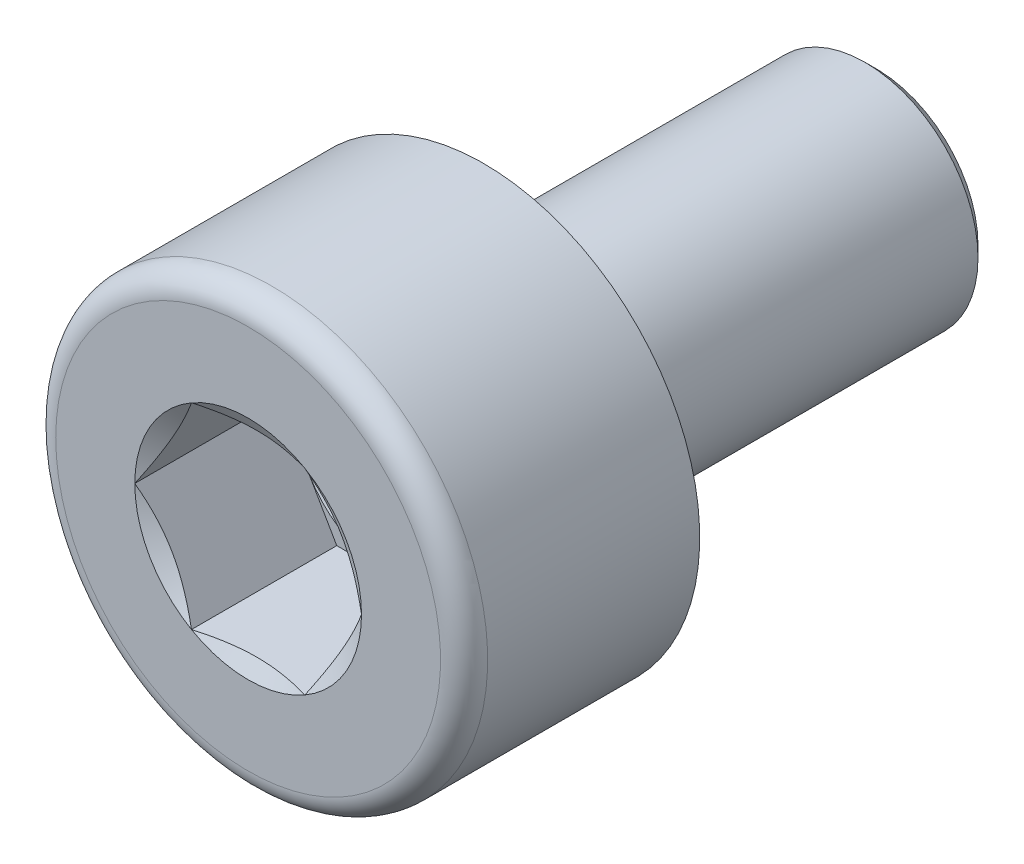
ISO-10303-21;
HEADER;
FILE_DESCRIPTION(('STEP AP214'),'2;1');
FILE_NAME('part.step','',(''),(''),'','','');
FILE_SCHEMA(('AUTOMOTIVE_DESIGN { 1 0 10303 214 1 1 1 1 }'));
ENDSEC;
DATA;
#1=APPLICATION_CONTEXT('core data for automotive mechanical design processes');
#2=APPLICATION_PROTOCOL_DEFINITION('international standard','automotive_design',2000,#1);
#3=PRODUCT_CONTEXT('',#1,'mechanical');
#4=PRODUCT('Part','Part','',(#3));
#5=PRODUCT_RELATED_PRODUCT_CATEGORY('part','',(#4));
#6=PRODUCT_DEFINITION_FORMATION('','',#4);
#7=PRODUCT_DEFINITION_CONTEXT('part definition',#1,'design');
#8=PRODUCT_DEFINITION('design','',#6,#7);
#9=PRODUCT_DEFINITION_SHAPE('','',#8);
#10=(LENGTH_UNIT() NAMED_UNIT(*) SI_UNIT(.MILLI.,.METRE.));
#11=(NAMED_UNIT(*) PLANE_ANGLE_UNIT() SI_UNIT($,.RADIAN.));
#12=(NAMED_UNIT(*) SI_UNIT($,.STERADIAN.) SOLID_ANGLE_UNIT());
#13=UNCERTAINTY_MEASURE_WITH_UNIT(LENGTH_MEASURE(1.E-05),#10,'distance_accuracy_value','');
#14=(GEOMETRIC_REPRESENTATION_CONTEXT(3) GLOBAL_UNCERTAINTY_ASSIGNED_CONTEXT((#13)) GLOBAL_UNIT_ASSIGNED_CONTEXT((#10,
#11,#12)) REPRESENTATION_CONTEXT('',''));
#15=CARTESIAN_POINT('',(0.,0.,0.));
#16=DIRECTION('',(0.,0.,1.));
#17=DIRECTION('',(1.,0.,0.));
#18=AXIS2_PLACEMENT_3D('',#15,#16,#17);
#19=CARTESIAN_POINT('',(0.,1.437,-5.));
#20=DIRECTION('',(0.,0.,1.));
#21=DIRECTION('',(1.,0.,0.));
#22=AXIS2_PLACEMENT_3D('',#19,#20,#21);
#23=PLANE('',#22);
#24=CARTESIAN_POINT('',(0.,0.,-5.));
#25=DIRECTION('',(0.,0.,1.));
#26=DIRECTION('',(1.,0.,0.));
#27=AXIS2_PLACEMENT_3D('',#24,#25,#26);
#28=CIRCLE('',#27,1.2933);
#29=CARTESIAN_POINT('',(1.2933,0.,-5.));
#30=VERTEX_POINT('',#29);
#31=EDGE_CURVE('E25',#30,#30,#28,.F.);
#32=ORIENTED_EDGE('',*,*,#31,.T.);
#33=EDGE_LOOP('',(#32));
#34=FACE_BOUND('',#33,.T.);
#35=ADVANCED_FACE('F17',(#34),#23,.F.);
#36=CARTESIAN_POINT('',(0.,0.,3.));
#37=DIRECTION('',(0.,0.,-1.));
#38=DIRECTION('',(-1.,0.,0.));
#39=AXIS2_PLACEMENT_3D('',#36,#37,#38);
#40=PLANE('',#39);
#41=CARTESIAN_POINT('',(0.,0.,3.));
#42=DIRECTION('',(0.,0.,-1.));
#43=DIRECTION('',(-1.,0.,0.));
#44=AXIS2_PLACEMENT_3D('',#41,#42,#43);
#45=CIRCLE('',#44,2.45);
#46=CARTESIAN_POINT('',(-2.45,0.,3.));
#47=VERTEX_POINT('',#46);
#48=EDGE_CURVE('E273',#47,#47,#45,.F.);
#49=ORIENTED_EDGE('',*,*,#48,.T.);
#50=EDGE_LOOP('',(#49));
#51=FACE_BOUND('',#50,.T.);
#52=CARTESIAN_POINT('',(0.,0.,3.));
#53=DIRECTION('',(0.,0.,-1.));
#54=DIRECTION('',(-1.,0.,0.));
#55=AXIS2_PLACEMENT_3D('',#52,#53,#54);
#56=CIRCLE('',#55,1.44337567297406);
#57=CARTESIAN_POINT('',(-0.721687836487033,-1.25,3.));
#58=VERTEX_POINT('',#57);
#59=CARTESIAN_POINT('',(-1.44337567297406,0.,3.));
#60=VERTEX_POINT('',#59);
#61=EDGE_CURVE('E284',#58,#60,#56,.T.);
#62=ORIENTED_EDGE('',*,*,#61,.T.);
#63=CARTESIAN_POINT('',(-0.72168783648703,1.25,3.));
#64=VERTEX_POINT('',#63);
#65=EDGE_CURVE('E107',#60,#64,#56,.T.);
#66=ORIENTED_EDGE('',*,*,#65,.T.);
#67=CARTESIAN_POINT('',(0.721687836487035,1.25,3.));
#68=VERTEX_POINT('',#67);
#69=EDGE_CURVE('E294',#64,#68,#56,.T.);
#70=ORIENTED_EDGE('',*,*,#69,.T.);
#71=CARTESIAN_POINT('',(1.44337567297406,0.,3.));
#72=VERTEX_POINT('',#71);
#73=EDGE_CURVE('E295',#68,#72,#56,.T.);
#74=ORIENTED_EDGE('',*,*,#73,.T.);
#75=CARTESIAN_POINT('',(0.721687836487033,-1.25,3.));
#76=VERTEX_POINT('',#75);
#77=EDGE_CURVE('E293',#72,#76,#56,.T.);
#78=ORIENTED_EDGE('',*,*,#77,.T.);
#79=EDGE_CURVE('E289',#76,#58,#56,.T.);
#80=ORIENTED_EDGE('',*,*,#79,.T.);
#81=EDGE_LOOP('',(#62,#66,#70,#74,#78,#80));
#82=FACE_BOUND('',#81,.T.);
#83=ADVANCED_FACE('F256',(#51,#82),#40,.F.);
#84=CARTESIAN_POINT('',(0.,0.,0.));
#85=DIRECTION('',(0.,0.,-1.));
#86=DIRECTION('',(-1.,0.,0.));
#87=AXIS2_PLACEMENT_3D('',#84,#85,#86);
#88=CYLINDRICAL_SURFACE('',#87,2.75);
#89=CARTESIAN_POINT('',(0.,0.,2.7));
#90=DIRECTION('',(0.,0.,-1.));
#91=DIRECTION('',(-1.,0.,0.));
#92=AXIS2_PLACEMENT_3D('',#89,#90,#91);
#93=CIRCLE('',#92,2.75);
#94=CARTESIAN_POINT('',(-2.75,0.,2.7));
#95=VERTEX_POINT('',#94);
#96=EDGE_CURVE('E175',#95,#95,#93,.T.);
#97=ORIENTED_EDGE('',*,*,#96,.T.);
#98=EDGE_LOOP('',(#97));
#99=FACE_BOUND('',#98,.T.);
#100=CARTESIAN_POINT('',(0.,0.,0.));
#101=DIRECTION('',(0.,0.,-1.));
#102=DIRECTION('',(-1.,0.,0.));
#103=AXIS2_PLACEMENT_3D('',#100,#101,#102);
#104=CIRCLE('',#103,2.75);
#105=CARTESIAN_POINT('',(-2.75,0.,0.));
#106=VERTEX_POINT('',#105);
#107=EDGE_CURVE('E117',#106,#106,#104,.T.);
#108=ORIENTED_EDGE('',*,*,#107,.F.);
#109=EDGE_LOOP('',(#108));
#110=FACE_BOUND('',#109,.T.);
#111=ADVANCED_FACE('F252',(#99,#110),#88,.T.);
#112=CARTESIAN_POINT('',(0.,2.75,0.));
#113=DIRECTION('',(0.,0.,1.));
#114=DIRECTION('',(1.,0.,0.));
#115=AXIS2_PLACEMENT_3D('',#112,#113,#114);
#116=PLANE('',#115);
#117=CARTESIAN_POINT('',(0.,0.,0.));
#118=DIRECTION('',(0.,0.,-1.));
#119=DIRECTION('',(-1.,0.,0.));
#120=AXIS2_PLACEMENT_3D('',#117,#118,#119);
#121=CIRCLE('',#120,1.8);
#122=CARTESIAN_POINT('',(-1.8,0.,0.));
#123=VERTEX_POINT('',#122);
#124=EDGE_CURVE('E161',#123,#123,#121,.T.);
#125=ORIENTED_EDGE('',*,*,#124,.F.);
#126=EDGE_LOOP('',(#125));
#127=FACE_BOUND('',#126,.T.);
#128=ORIENTED_EDGE('',*,*,#107,.T.);
#129=EDGE_LOOP('',(#128));
#130=FACE_BOUND('',#129,.T.);
#131=ADVANCED_FACE('F248',(#127,#130),#116,.F.);
#132=CARTESIAN_POINT('',(0.,0.,-0.100000000000001));
#133=DIRECTION('',(0.,0.,-1.));
#134=DIRECTION('',(-1.,0.,0.));
#135=AXIS2_PLACEMENT_3D('',#132,#133,#134);
#136=TOROIDAL_SURFACE('',#135,1.8,0.100000000000001);
#137=CARTESIAN_POINT('',(0.,0.,-0.0460072747777011));
#138=DIRECTION('',(0.,0.,-1.));
#139=DIRECTION('',(-1.,0.,0.));
#140=AXIS2_PLACEMENT_3D('',#137,#138,#139);
#141=CIRCLE('',#140,1.71582883140249);
#142=CARTESIAN_POINT('',(-1.71582883140249,0.,-0.0460072747777011));
#143=VERTEX_POINT('',#142);
#144=EDGE_CURVE('E158',#143,#143,#141,.T.);
#145=ORIENTED_EDGE('',*,*,#144,.F.);
#146=EDGE_LOOP('',(#145));
#147=FACE_BOUND('',#146,.T.);
#148=ORIENTED_EDGE('',*,*,#124,.T.);
#149=EDGE_LOOP('',(#148));
#150=FACE_BOUND('',#149,.T.);
#151=ADVANCED_FACE('F244',(#147,#150),#136,.F.);
#152=CARTESIAN_POINT('',(0.,0.,-0.0460072747777011));
#153=DIRECTION('',(0.,0.,1.));
#154=DIRECTION('',(1.,0.,0.));
#155=AXIS2_PLACEMENT_3D('',#152,#153,#154);
#156=CONICAL_SURFACE('',#155,1.71582883140249,0.570350678624392);
#157=CARTESIAN_POINT('',(0.,0.,-0.456007274777701));
#158=DIRECTION('',(0.,0.,-1.));
#159=DIRECTION('',(-1.,0.,0.));
#160=AXIS2_PLACEMENT_3D('',#157,#158,#159);
#161=CIRCLE('',#160,1.4528288314025);
#162=CARTESIAN_POINT('',(-1.4528288314025,0.,-0.456007274777701));
#163=VERTEX_POINT('',#162);
#164=EDGE_CURVE('E155',#163,#163,#161,.T.);
#165=ORIENTED_EDGE('',*,*,#164,.F.);
#166=EDGE_LOOP('',(#165));
#167=FACE_BOUND('',#166,.T.);
#168=ORIENTED_EDGE('',*,*,#144,.T.);
#169=EDGE_LOOP('',(#168));
#170=FACE_BOUND('',#169,.T.);
#171=ADVANCED_FACE('F240',(#167,#170),#156,.T.);
#172=CARTESIAN_POINT('',(0.,0.,-0.51));
#173=DIRECTION('',(0.,0.,-1.));
#174=DIRECTION('',(-1.,0.,0.));
#175=AXIS2_PLACEMENT_3D('',#172,#173,#174);
#176=TOROIDAL_SURFACE('',#175,1.537,0.1);
#177=CARTESIAN_POINT('',(0.,0.,-0.51));
#178=DIRECTION('',(0.,0.,-1.));
#179=DIRECTION('',(-1.,0.,0.));
#180=AXIS2_PLACEMENT_3D('',#177,#178,#179);
#181=CIRCLE('',#180,1.437);
#182=CARTESIAN_POINT('',(-1.437,0.,-0.51));
#183=VERTEX_POINT('',#182);
#184=EDGE_CURVE('E151',#183,#183,#181,.T.);
#185=ORIENTED_EDGE('',*,*,#184,.F.);
#186=EDGE_LOOP('',(#185));
#187=FACE_BOUND('',#186,.T.);
#188=ORIENTED_EDGE('',*,*,#164,.T.);
#189=EDGE_LOOP('',(#188));
#190=FACE_BOUND('',#189,.T.);
#191=ADVANCED_FACE('F236',(#187,#190),#176,.F.);
#192=CARTESIAN_POINT('',(0.,0.,0.));
#193=DIRECTION('',(0.,0.,-1.));
#194=DIRECTION('',(-1.,0.,0.));
#195=AXIS2_PLACEMENT_3D('',#192,#193,#194);
#196=CYLINDRICAL_SURFACE('',#195,1.437);
#197=CARTESIAN_POINT('',(0.,0.,-4.8563));
#198=DIRECTION('',(0.,0.,1.));
#199=DIRECTION('',(1.,0.,0.));
#200=AXIS2_PLACEMENT_3D('',#197,#198,#199);
#201=CIRCLE('',#200,1.437);
#202=CARTESIAN_POINT('',(1.437,0.,-4.8563));
#203=VERTEX_POINT('',#202);
#204=EDGE_CURVE('E11',#203,#203,#201,.T.);
#205=ORIENTED_EDGE('',*,*,#204,.T.);
#206=EDGE_LOOP('',(#205));
#207=FACE_BOUND('',#206,.T.);
#208=ORIENTED_EDGE('',*,*,#184,.T.);
#209=EDGE_LOOP('',(#208));
#210=FACE_BOUND('',#209,.T.);
#211=ADVANCED_FACE('F233',(#207,#210),#196,.T.);
#212=CARTESIAN_POINT('',(0.,0.,3.));
#213=DIRECTION('',(0.,0.,1.));
#214=DIRECTION('',(1.,0.,0.));
#215=AXIS2_PLACEMENT_3D('',#212,#213,#214);
#216=CONICAL_SURFACE('',#215,1.44337567297406,1.04719755119659);
#217=ORIENTED_EDGE('',*,*,#65,.F.);
#218=CARTESIAN_POINT('',(-1.4434911430279,-0.000199999999997675,3.00006667466602));
#219=CARTESIAN_POINT('',(-1.41177538446487,0.0547333052317676,2.98174591476369));
#220=CARTESIAN_POINT('',(-1.37978586023939,0.110140786500242,2.96508330620064));
#221=CARTESIAN_POINT('',(-1.31525277575269,0.221915367600343,2.93599730394577));
#222=CARTESIAN_POINT('',(-1.28270806805991,0.278284454841713,2.92358420197605));
#223=CARTESIAN_POINT('',(-1.21802202146378,0.390323974086987,2.90425968763601));
#224=CARTESIAN_POINT('',(-1.1858906404852,0.445977158459233,2.89721968944743));
#225=CARTESIAN_POINT('',(-1.12147653960455,0.557545653908395,2.88881243263063));
#226=CARTESIAN_POINT('',(-1.08919405413422,0.613460558937603,2.88743821520472));
#227=CARTESIAN_POINT('',(-1.02886247391297,0.717957921181728,2.89028333736792));
#228=CARTESIAN_POINT('',(-1.00080438896118,0.766555949881318,2.89380409882001));
#229=CARTESIAN_POINT('',(-0.944871034195502,0.863435362173241,2.90496711269925));
#230=CARTESIAN_POINT('',(-0.916995958125019,0.911716410192166,2.91261318557268));
#231=CARTESIAN_POINT('',(-0.860947097873546,1.00879588385404,2.93172945470053));
#232=CARTESIAN_POINT('',(-0.832780414607289,1.0575820103519,2.94328075697966));
#233=CARTESIAN_POINT('',(-0.776867365453648,1.1544262522921,2.96949831469389));
#234=CARTESIAN_POINT('',(-0.74912028215514,1.20248561032696,2.9841584021391));
#235=CARTESIAN_POINT('',(-0.721572366433193,1.2502,3.00006667466602));
#236=B_SPLINE_CURVE_WITH_KNOTS('',3,(#218,#219,#220,#221,#222,#223,#224,#225,#226,#227,#228,
#229,#230,#231,#232,#233,#234,#235),.UNSPECIFIED.,.F.,.F.,(4,2,2,2,2,2,2,2,4),(0.,
0.19815082102956,0.396778196315221,0.590488617354401,0.783961049317183,0.952480056398647,
1.1211553973001,1.2935743034359,1.4656542697693),.UNSPECIFIED.);
#237=EDGE_CURVE('E166',#60,#64,#236,.T.);
#238=ORIENTED_EDGE('',*,*,#237,.T.);
#239=EDGE_LOOP('',(#217,#238));
#240=FACE_BOUND('',#239,.T.);
#241=ADVANCED_FACE('F184',(#240),#216,.F.);
#242=CARTESIAN_POINT('',(-0.721572366433195,-1.2502,3.00006667466602));
#243=CARTESIAN_POINT('',(-0.753288124996231,-1.19526669476823,2.98174591476369));
#244=CARTESIAN_POINT('',(-0.785277649221704,-1.13985921349976,2.96508330620064));
#245=CARTESIAN_POINT('',(-0.849810733708404,-1.02808463239966,2.93599730394577));
#246=CARTESIAN_POINT('',(-0.882355441401183,-0.971715545158289,2.92358420197605));
#247=CARTESIAN_POINT('',(-0.947041487997319,-0.859676025913014,2.90425968763601));
#248=CARTESIAN_POINT('',(-0.979172868975895,-0.804022841540769,2.89721968944743));
#249=CARTESIAN_POINT('',(-1.04358696985655,-0.692454346091607,2.88881243263063));
#250=CARTESIAN_POINT('',(-1.07586945532688,-0.636539441062398,2.88743821520472));
#251=CARTESIAN_POINT('',(-1.13620103554813,-0.532042078818273,2.89028333736791));
#252=CARTESIAN_POINT('',(-1.16425912049992,-0.483444050118683,2.89380409882001));
#253=CARTESIAN_POINT('',(-1.22019247526559,-0.386564637826761,2.90496711269926));
#254=CARTESIAN_POINT('',(-1.24806755133608,-0.338283589807835,2.91261318557268));
#255=CARTESIAN_POINT('',(-1.30411641158755,-0.241204116145956,2.93172945470053));
#256=CARTESIAN_POINT('',(-1.33228309485381,-0.1924179896481,2.94328075697966));
#257=CARTESIAN_POINT('',(-1.38819614400745,-0.0955737477078969,2.96949831469389));
#258=CARTESIAN_POINT('',(-1.41594322730596,-0.0475143896730343,2.98415840213911));
#259=CARTESIAN_POINT('',(-1.4434911430279,0.000200000000002268,3.00006667466602));
#260=B_SPLINE_CURVE_WITH_KNOTS('',3,(#242,#243,#244,#245,#246,#247,#248,#249,#250,#251,#252,
#253,#254,#255,#256,#257,#258,#259),.UNSPECIFIED.,.F.,.F.,(4,2,2,2,2,2,2,2,4),(0.,
0.19815082102956,0.396778196315222,0.590488617354402,0.783961049317184,0.952480056398648,
1.1211553973001,1.2935743034359,1.4656542697693),.UNSPECIFIED.);
#261=EDGE_CURVE('E106',#58,#60,#260,.T.);
#262=ORIENTED_EDGE('',*,*,#261,.T.);
#263=ORIENTED_EDGE('',*,*,#61,.F.);
#264=EDGE_LOOP('',(#262,#263));
#265=FACE_BOUND('',#264,.T.);
#266=ADVANCED_FACE('F339',(#265),#216,.F.);
#267=CARTESIAN_POINT('',(-1.91402249686216,-1.25,3.48651288479141));
#268=CARTESIAN_POINT('',(-1.85914046049582,-1.25,3.45999038335154));
#269=CARTESIAN_POINT('',(-1.80412861642413,-1.25,3.43373221461557));
#270=CARTESIAN_POINT('',(-1.69377524880197,-1.25,3.38189383879485));
#271=CARTESIAN_POINT('',(-1.63843367017623,-1.25,3.35631374909162));
#272=CARTESIAN_POINT('',(-1.52705181896546,-1.25,3.30584606568502));
#273=CARTESIAN_POINT('',(-1.471009360369,-1.25,3.28096327255609));
#274=CARTESIAN_POINT('',(-1.3584634322514,-1.25,3.23227191506865));
#275=CARTESIAN_POINT('',(-1.30195998694251,-1.25,3.20846329471518));
#276=CARTESIAN_POINT('',(-1.13023285932381,-1.25,3.13847265448235));
#277=CARTESIAN_POINT('',(-1.01415191825627,-1.25,3.09435658102078));
#278=CARTESIAN_POINT('',(-0.779052794443726,-1.25,3.01526341646949));
#279=CARTESIAN_POINT('',(-0.660042536750821,-1.25,2.98026411818164));
#280=CARTESIAN_POINT('',(-0.47893263622699,-1.25,2.93885499673143));
#281=CARTESIAN_POINT('',(-0.418117317139982,-1.25,2.92689892661569));
#282=CARTESIAN_POINT('',(-0.295751634794787,-1.25,2.90750168027795));
#283=CARTESIAN_POINT('',(-0.234201270886778,-1.25,2.90006050804768));
#284=CARTESIAN_POINT('',(-0.111078085132805,-1.25,2.89034953143358));
#285=CARTESIAN_POINT('',(-0.0495079196542184,-1.25,2.88804698816604));
#286=CARTESIAN_POINT('',(0.0735831621738639,-1.25,2.88872894537047));
#287=CARTESIAN_POINT('',(0.135104087159245,-1.25,2.89171207343273));
#288=CARTESIAN_POINT('',(0.283935785341007,-1.25,2.90505722791002));
#289=CARTESIAN_POINT('',(0.371012804095998,-1.25,2.91803134932696));
#290=CARTESIAN_POINT('',(0.543555810943381,-1.25,2.95222917957144));
#291=CARTESIAN_POINT('',(0.629019779096373,-1.25,2.9734625943366));
#292=CARTESIAN_POINT('',(0.756929416866877,-1.25,3.01007884490288));
#293=CARTESIAN_POINT('',(0.800029095074483,-1.25,3.02326523899134));
#294=CARTESIAN_POINT('',(0.885776202763547,-1.25,3.05094330554174));
#295=CARTESIAN_POINT('',(0.928423921808507,-1.25,3.06543407771215));
#296=CARTESIAN_POINT('',(1.01309180163563,-1.25,3.09541882069064));
#297=CARTESIAN_POINT('',(1.05511414357455,-1.25,3.11090668572693));
#298=CARTESIAN_POINT('',(1.13883279115284,-1.25,3.14279147043058));
#299=CARTESIAN_POINT('',(1.1805289571388,-1.25,3.15918875750689));
#300=CARTESIAN_POINT('',(1.22207405933337,-1.25,3.175951067698));
#301=B_SPLINE_CURVE_WITH_KNOTS('',3,(#267,#268,#269,#270,#271,#272,#273,#274,#275,#276,#277,
#278,#279,#280,#281,#282,#283,#284,#285,#286,#287,#288,#289,#290,#291,#292,#293,#294,#295,#296,
#297,#298,#299,#300),.UNSPECIFIED.,.F.,.F.,(4,2,2,2,2,2,2,2,2,2,2,2,2,2,2,2,4),(0.,
0.182866185166336,0.365763822062273,0.549708108268721,0.733642794640087,1.10600436119169,
1.47745024072251,1.66325057096118,1.84905106547046,2.03366437966803,2.21822976656131,
2.48180397426805,2.74568886248364,2.88088820791444,3.01599494297259,3.15034120655594,
3.28474214746062),.UNSPECIFIED.);
#302=EDGE_CURVE('E197',#76,#58,#301,.F.);
#303=ORIENTED_EDGE('',*,*,#302,.T.);
#304=ORIENTED_EDGE('',*,*,#79,.F.);
#305=EDGE_LOOP('',(#303,#304));
#306=FACE_BOUND('',#305,.T.);
#307=ADVANCED_FACE('F343',(#306),#216,.F.);
#308=CARTESIAN_POINT('',(1.4434911430279,0.000199999999998967,3.00006667466602));
#309=CARTESIAN_POINT('',(1.41177538446487,-0.0547333052317663,2.98174591476369));
#310=CARTESIAN_POINT('',(1.37978586023939,-0.110140786500241,2.96508330620064));
#311=CARTESIAN_POINT('',(1.31525277575269,-0.221915367600341,2.93599730394577));
#312=CARTESIAN_POINT('',(1.28270806805991,-0.278284454841712,2.92358420197605));
#313=CARTESIAN_POINT('',(1.21802202146378,-0.390323974086986,2.90425968763601));
#314=CARTESIAN_POINT('',(1.1858906404852,-0.445977158459232,2.89721968944743));
#315=CARTESIAN_POINT('',(1.12147653960455,-0.557545653908394,2.88881243263063));
#316=CARTESIAN_POINT('',(1.08919405413422,-0.613460558937602,2.88743821520472));
#317=CARTESIAN_POINT('',(1.02886247391297,-0.717957921181727,2.89028333736791));
#318=CARTESIAN_POINT('',(1.00080438896118,-0.766555949881317,2.89380409882001));
#319=CARTESIAN_POINT('',(0.944871034195502,-0.863435362173239,2.90496711269925));
#320=CARTESIAN_POINT('',(0.916995958125019,-0.911716410192164,2.91261318557268));
#321=CARTESIAN_POINT('',(0.860947097873545,-1.00879588385404,2.93172945470053));
#322=CARTESIAN_POINT('',(0.832780414607289,-1.0575820103519,2.94328075697966));
#323=CARTESIAN_POINT('',(0.776867365453648,-1.1544262522921,2.96949831469389));
#324=CARTESIAN_POINT('',(0.749120282155139,-1.20248561032696,2.9841584021391));
#325=CARTESIAN_POINT('',(0.721572366433193,-1.2502,3.00006667466602));
#326=B_SPLINE_CURVE_WITH_KNOTS('',3,(#308,#309,#310,#311,#312,#313,#314,#315,#316,#317,#318,
#319,#320,#321,#322,#323,#324,#325),.UNSPECIFIED.,.F.,.F.,(4,2,2,2,2,2,2,2,4),(0.,
0.19815082102956,0.396778196315222,0.590488617354401,0.783961049317183,0.952480056398647,
1.1211553973001,1.2935743034359,1.4656542697693),.UNSPECIFIED.);
#327=EDGE_CURVE('E204',#72,#76,#326,.T.);
#328=ORIENTED_EDGE('',*,*,#327,.T.);
#329=ORIENTED_EDGE('',*,*,#77,.F.);
#330=EDGE_LOOP('',(#328,#329));
#331=FACE_BOUND('',#330,.T.);
#332=ADVANCED_FACE('F299',(#331),#216,.F.);
#333=CARTESIAN_POINT('',(0.721572366433196,1.2502,3.00006667466602));
#334=CARTESIAN_POINT('',(0.753288124996232,1.19526669476823,2.98174591476369));
#335=CARTESIAN_POINT('',(0.785277649221705,1.13985921349976,2.96508330620064));
#336=CARTESIAN_POINT('',(0.849810733708406,1.02808463239966,2.93599730394577));
#337=CARTESIAN_POINT('',(0.882355441401184,0.971715545158289,2.92358420197605));
#338=CARTESIAN_POINT('',(0.94704148799732,0.859676025913015,2.90425968763601));
#339=CARTESIAN_POINT('',(0.979172868975896,0.80402284154077,2.89721968944743));
#340=CARTESIAN_POINT('',(1.04358696985655,0.692454346091607,2.88881243263063));
#341=CARTESIAN_POINT('',(1.07586945532687,0.636539441062397,2.88743821520472));
#342=CARTESIAN_POINT('',(1.13620103554813,0.532042078818272,2.89028333736792));
#343=CARTESIAN_POINT('',(1.16425912049992,0.483444050118682,2.89380409882001));
#344=CARTESIAN_POINT('',(1.2201924752656,0.38656463782676,2.90496711269925));
#345=CARTESIAN_POINT('',(1.24806755133608,0.338283589807835,2.91261318557268));
#346=CARTESIAN_POINT('',(1.30411641158755,0.241204116145956,2.93172945470053));
#347=CARTESIAN_POINT('',(1.33228309485381,0.1924179896481,2.94328075697966));
#348=CARTESIAN_POINT('',(1.38819614400745,0.0955737477078979,2.96949831469389));
#349=CARTESIAN_POINT('',(1.41594322730596,0.0475143896730355,2.98415840213911));
#350=CARTESIAN_POINT('',(1.4434911430279,-0.00020000000000122,3.00006667466602));
#351=B_SPLINE_CURVE_WITH_KNOTS('',3,(#333,#334,#335,#336,#337,#338,#339,#340,#341,#342,#343,
#344,#345,#346,#347,#348,#349,#350),.UNSPECIFIED.,.F.,.F.,(4,2,2,2,2,2,2,2,4),(0.,
0.19815082102956,0.396778196315222,0.590488617354401,0.783961049317184,0.952480056398648,
1.1211553973001,1.2935743034359,1.4656542697693),.UNSPECIFIED.);
#352=EDGE_CURVE('E37',#68,#72,#351,.T.);
#353=ORIENTED_EDGE('',*,*,#352,.T.);
#354=ORIENTED_EDGE('',*,*,#73,.F.);
#355=EDGE_LOOP('',(#353,#354));
#356=FACE_BOUND('',#355,.T.);
#357=ADVANCED_FACE('F183',(#356),#216,.F.);
#358=CARTESIAN_POINT('',(-1.91402249686216,1.25,3.48651288479141));
#359=CARTESIAN_POINT('',(-1.85914046049581,1.25,3.45999038335154));
#360=CARTESIAN_POINT('',(-1.80412861642413,1.25,3.43373221461557));
#361=CARTESIAN_POINT('',(-1.69377524880197,1.25,3.38189383879485));
#362=CARTESIAN_POINT('',(-1.63843367017622,1.25,3.35631374909161));
#363=CARTESIAN_POINT('',(-1.52705181896546,1.25,3.30584606568501));
#364=CARTESIAN_POINT('',(-1.471009360369,1.25,3.28096327255609));
#365=CARTESIAN_POINT('',(-1.35846343225139,1.25,3.23227191506865));
#366=CARTESIAN_POINT('',(-1.3019599869425,1.25,3.20846329471518));
#367=CARTESIAN_POINT('',(-1.13023285932381,1.25,3.13847265448235));
#368=CARTESIAN_POINT('',(-1.01415191825627,1.25,3.09435658102077));
#369=CARTESIAN_POINT('',(-0.779052794443723,1.25,3.01526341646949));
#370=CARTESIAN_POINT('',(-0.660042536750817,1.25,2.98026411818164));
#371=CARTESIAN_POINT('',(-0.478932636226987,1.25,2.93885499673143));
#372=CARTESIAN_POINT('',(-0.418117317139979,1.25,2.92689892661569));
#373=CARTESIAN_POINT('',(-0.295751634794785,1.25,2.90750168027795));
#374=CARTESIAN_POINT('',(-0.234201270886775,1.25,2.90006050804768));
#375=CARTESIAN_POINT('',(-0.111078085132802,1.25,2.89034953143358));
#376=CARTESIAN_POINT('',(-0.0495079196542156,1.25,2.88804698816604));
#377=CARTESIAN_POINT('',(0.0735831621738667,1.25,2.88872894537047));
#378=CARTESIAN_POINT('',(0.135104087159248,1.25,2.89171207343273));
#379=CARTESIAN_POINT('',(0.283935785341009,1.25,2.90505722791002));
#380=CARTESIAN_POINT('',(0.371012804096,1.25,2.91803134932696));
#381=CARTESIAN_POINT('',(0.543555810943384,1.25,2.95222917957144));
#382=CARTESIAN_POINT('',(0.629019779096376,1.25,2.9734625943366));
#383=CARTESIAN_POINT('',(0.75692941686688,1.25,3.01007884490288));
#384=CARTESIAN_POINT('',(0.800029095074486,1.25,3.02326523899134));
#385=CARTESIAN_POINT('',(0.88577620276355,1.25,3.05094330554174));
#386=CARTESIAN_POINT('',(0.92842392180851,1.25,3.06543407771215));
#387=CARTESIAN_POINT('',(1.01309180163563,1.25,3.09541882069064));
#388=CARTESIAN_POINT('',(1.05511414357455,1.25,3.11090668572694));
#389=CARTESIAN_POINT('',(1.13883279115285,1.25,3.14279147043058));
#390=CARTESIAN_POINT('',(1.1805289571388,1.25,3.15918875750689));
#391=CARTESIAN_POINT('',(1.22207405933337,1.25,3.175951067698));
#392=B_SPLINE_CURVE_WITH_KNOTS('',3,(#358,#359,#360,#361,#362,#363,#364,#365,#366,#367,#368,
#369,#370,#371,#372,#373,#374,#375,#376,#377,#378,#379,#380,#381,#382,#383,#384,#385,#386,#387,
#388,#389,#390,#391),.UNSPECIFIED.,.F.,.F.,(4,2,2,2,2,2,2,2,2,2,2,2,2,2,2,2,4),(0.,
0.182866185166335,0.365763822062272,0.549708108268719,0.733642794640086,1.10600436119169,
1.47745024072251,1.66325057096118,1.84905106547045,2.03366437966803,2.21822976656131,
2.48180397426804,2.74568886248363,2.88088820791444,3.01599494297259,3.15034120655594,
3.28474214746062),.UNSPECIFIED.);
#393=EDGE_CURVE('E31',#64,#68,#392,.T.);
#394=ORIENTED_EDGE('',*,*,#393,.T.);
#395=ORIENTED_EDGE('',*,*,#69,.F.);
#396=EDGE_LOOP('',(#394,#395));
#397=FACE_BOUND('',#396,.T.);
#398=ADVANCED_FACE('F180',(#397),#216,.F.);
#399=CARTESIAN_POINT('',(0.721687836487034,1.25,1.15));
#400=DIRECTION('',(0.,0.,-1.));
#401=DIRECTION('',(-1.,0.,0.));
#402=AXIS2_PLACEMENT_3D('',#399,#400,#401);
#403=PLANE('',#402);
#404=CARTESIAN_POINT('',(0.,0.,1.15));
#405=DIRECTION('',(0.,0.,-1.));
#406=DIRECTION('',(-1.,0.,0.));
#407=AXIS2_PLACEMENT_3D('',#404,#405,#406);
#408=CIRCLE('',#407,1.25);
#409=CARTESIAN_POINT('',(-1.08253175473055,0.625,1.15));
#410=VERTEX_POINT('',#409);
#411=CARTESIAN_POINT('',(0.,1.25,1.15));
#412=VERTEX_POINT('',#411);
#413=EDGE_CURVE('E96',#410,#412,#408,.T.);
#414=ORIENTED_EDGE('',*,*,#413,.T.);
#415=DIRECTION('',(1.,0.,0.));
#416=VECTOR('',#415,1.);
#417=CARTESIAN_POINT('',(-0.721687836487031,1.25,1.15));
#418=LINE('',#417,#416);
#419=CARTESIAN_POINT('',(-0.721687836487031,1.25,1.15));
#420=VERTEX_POINT('',#419);
#421=EDGE_CURVE('E123',#420,#412,#418,.T.);
#422=ORIENTED_EDGE('',*,*,#421,.F.);
#423=DIRECTION('',(0.5,0.866025403784438,0.));
#424=VECTOR('',#423,1.);
#425=CARTESIAN_POINT('',(-1.44337567297406,0.,1.15));
#426=LINE('',#425,#424);
#427=EDGE_CURVE('E120',#410,#420,#426,.T.);
#428=ORIENTED_EDGE('',*,*,#427,.F.);
#429=EDGE_LOOP('',(#414,#422,#428));
#430=FACE_BOUND('',#429,.T.);
#431=ADVANCED_FACE('F121',(#430),#403,.F.);
#432=CARTESIAN_POINT('',(0.,0.,1.15));
#433=DIRECTION('',(0.,0.,-1.));
#434=DIRECTION('',(-1.,0.,0.));
#435=AXIS2_PLACEMENT_3D('',#432,#433,#434);
#436=CIRCLE('',#435,1.25);
#437=CARTESIAN_POINT('',(-1.08253175473055,-0.625,1.15));
#438=VERTEX_POINT('',#437);
#439=EDGE_CURVE('E98',#410,#438,#436,.F.);
#440=ORIENTED_EDGE('',*,*,#439,.F.);
#441=CARTESIAN_POINT('',(-1.44337567297406,0.,1.15));
#442=VERTEX_POINT('',#441);
#443=EDGE_CURVE('E114',#442,#410,#426,.T.);
#444=ORIENTED_EDGE('',*,*,#443,.F.);
#445=DIRECTION('',(-0.5,0.866025403784439,0.));
#446=VECTOR('',#445,1.);
#447=CARTESIAN_POINT('',(-0.721687836487033,-1.25,1.15));
#448=LINE('',#447,#446);
#449=EDGE_CURVE('E115',#438,#442,#448,.T.);
#450=ORIENTED_EDGE('',*,*,#449,.F.);
#451=EDGE_LOOP('',(#440,#444,#450));
#452=FACE_BOUND('',#451,.T.);
#453=ADVANCED_FACE('F112',(#452),#403,.F.);
#454=CARTESIAN_POINT('',(-1.44337567297406,0.,3.));
#455=DIRECTION('',(-0.866025403784438,0.5,0.));
#456=DIRECTION('',(-0.5,-0.866025403784438,0.));
#457=AXIS2_PLACEMENT_3D('',#454,#455,#456);
#458=PLANE('',#457);
#459=ORIENTED_EDGE('',*,*,#443,.T.);
#460=ORIENTED_EDGE('',*,*,#427,.T.);
#461=DIRECTION('',(0.,0.,-1.));
#462=VECTOR('',#461,1.);
#463=CARTESIAN_POINT('',(-0.721687836487031,1.25,3.));
#464=LINE('',#463,#462);
#465=EDGE_CURVE('E134',#64,#420,#464,.T.);
#466=ORIENTED_EDGE('',*,*,#465,.F.);
#467=ORIENTED_EDGE('',*,*,#237,.F.);
#468=DIRECTION('',(0.,0.,-1.));
#469=VECTOR('',#468,1.);
#470=CARTESIAN_POINT('',(-1.44337567297406,0.,3.));
#471=LINE('',#470,#469);
#472=EDGE_CURVE('E133',#60,#442,#471,.T.);
#473=ORIENTED_EDGE('',*,*,#472,.T.);
#474=EDGE_LOOP('',(#459,#460,#466,#467,#473));
#475=FACE_BOUND('',#474,.T.);
#476=ADVANCED_FACE('F130',(#475),#458,.F.);
#477=CARTESIAN_POINT('',(0.,-1.25,1.15));
#478=VERTEX_POINT('',#477);
#479=EDGE_CURVE('E119',#438,#478,#436,.F.);
#480=ORIENTED_EDGE('',*,*,#479,.F.);
#481=CARTESIAN_POINT('',(-0.721687836487033,-1.25,1.15));
#482=VERTEX_POINT('',#481);
#483=EDGE_CURVE('E127',#482,#438,#448,.T.);
#484=ORIENTED_EDGE('',*,*,#483,.F.);
#485=DIRECTION('',(-1.,0.,0.));
#486=VECTOR('',#485,1.);
#487=CARTESIAN_POINT('',(0.721687836487031,-1.25,1.15));
#488=LINE('',#487,#486);
#489=EDGE_CURVE('E318',#478,#482,#488,.T.);
#490=ORIENTED_EDGE('',*,*,#489,.F.);
#491=EDGE_LOOP('',(#480,#484,#490));
#492=FACE_BOUND('',#491,.T.);
#493=ADVANCED_FACE('F331',(#492),#403,.F.);
#494=CARTESIAN_POINT('',(-0.721687836487033,-1.25,3.));
#495=DIRECTION('',(-0.866025403784439,-0.5,0.));
#496=DIRECTION('',(0.5,-0.866025403784439,0.));
#497=AXIS2_PLACEMENT_3D('',#494,#495,#496);
#498=PLANE('',#497);
#499=ORIENTED_EDGE('',*,*,#483,.T.);
#500=ORIENTED_EDGE('',*,*,#449,.T.);
#501=ORIENTED_EDGE('',*,*,#472,.F.);
#502=ORIENTED_EDGE('',*,*,#261,.F.);
#503=DIRECTION('',(0.,0.,-1.));
#504=VECTOR('',#503,1.);
#505=CARTESIAN_POINT('',(-0.721687836487033,-1.25,3.));
#506=LINE('',#505,#504);
#507=EDGE_CURVE('E140',#58,#482,#506,.T.);
#508=ORIENTED_EDGE('',*,*,#507,.T.);
#509=EDGE_LOOP('',(#499,#500,#501,#502,#508));
#510=FACE_BOUND('',#509,.T.);
#511=ADVANCED_FACE('F330',(#510),#498,.F.);
#512=CARTESIAN_POINT('',(1.08253175473055,-0.625,1.15));
#513=VERTEX_POINT('',#512);
#514=EDGE_CURVE('E333',#478,#513,#436,.F.);
#515=ORIENTED_EDGE('',*,*,#514,.F.);
#516=CARTESIAN_POINT('',(0.721687836487031,-1.25,1.15));
#517=VERTEX_POINT('',#516);
#518=EDGE_CURVE('E319',#517,#478,#488,.T.);
#519=ORIENTED_EDGE('',*,*,#518,.F.);
#520=DIRECTION('',(-0.5,-0.866025403784438,0.));
#521=VECTOR('',#520,1.);
#522=CARTESIAN_POINT('',(1.44337567297406,0.,1.15));
#523=LINE('',#522,#521);
#524=EDGE_CURVE('E314',#513,#517,#523,.T.);
#525=ORIENTED_EDGE('',*,*,#524,.F.);
#526=EDGE_LOOP('',(#515,#519,#525));
#527=FACE_BOUND('',#526,.T.);
#528=ADVANCED_FACE('F349',(#527),#403,.F.);
#529=CARTESIAN_POINT('',(0.721687836487031,-1.25,3.));
#530=DIRECTION('',(0.,-1.,0.));
#531=DIRECTION('',(0.,0.,-1.));
#532=AXIS2_PLACEMENT_3D('',#529,#530,#531);
#533=PLANE('',#532);
#534=ORIENTED_EDGE('',*,*,#518,.T.);
#535=ORIENTED_EDGE('',*,*,#489,.T.);
#536=ORIENTED_EDGE('',*,*,#507,.F.);
#537=ORIENTED_EDGE('',*,*,#302,.F.);
#538=DIRECTION('',(0.,0.,-1.));
#539=VECTOR('',#538,1.);
#540=CARTESIAN_POINT('',(0.721687836487031,-1.25,3.));
#541=LINE('',#540,#539);
#542=EDGE_CURVE('E143',#76,#517,#541,.T.);
#543=ORIENTED_EDGE('',*,*,#542,.T.);
#544=EDGE_LOOP('',(#534,#535,#536,#537,#543));
#545=FACE_BOUND('',#544,.T.);
#546=ADVANCED_FACE('F325',(#545),#533,.F.);
#547=CARTESIAN_POINT('',(1.08253175473055,0.625,1.15));
#548=VERTEX_POINT('',#547);
#549=EDGE_CURVE('E334',#513,#548,#436,.F.);
#550=ORIENTED_EDGE('',*,*,#549,.F.);
#551=CARTESIAN_POINT('',(1.44337567297406,0.,1.15));
#552=VERTEX_POINT('',#551);
#553=EDGE_CURVE('E317',#552,#513,#523,.T.);
#554=ORIENTED_EDGE('',*,*,#553,.F.);
#555=DIRECTION('',(0.5,-0.866025403784439,0.));
#556=VECTOR('',#555,1.);
#557=CARTESIAN_POINT('',(0.721687836487034,1.25,1.15));
#558=LINE('',#557,#556);
#559=EDGE_CURVE('E308',#548,#552,#558,.T.);
#560=ORIENTED_EDGE('',*,*,#559,.F.);
#561=EDGE_LOOP('',(#550,#554,#560));
#562=FACE_BOUND('',#561,.T.);
#563=ADVANCED_FACE('F350',(#562),#403,.F.);
#564=CARTESIAN_POINT('',(1.44337567297406,0.,3.));
#565=DIRECTION('',(0.866025403784438,-0.5,0.));
#566=DIRECTION('',(0.5,0.866025403784438,0.));
#567=AXIS2_PLACEMENT_3D('',#564,#565,#566);
#568=PLANE('',#567);
#569=ORIENTED_EDGE('',*,*,#553,.T.);
#570=ORIENTED_EDGE('',*,*,#524,.T.);
#571=ORIENTED_EDGE('',*,*,#542,.F.);
#572=ORIENTED_EDGE('',*,*,#327,.F.);
#573=DIRECTION('',(0.,0.,-1.));
#574=VECTOR('',#573,1.);
#575=CARTESIAN_POINT('',(1.44337567297406,0.,3.));
#576=LINE('',#575,#574);
#577=EDGE_CURVE('E146',#72,#552,#576,.T.);
#578=ORIENTED_EDGE('',*,*,#577,.T.);
#579=EDGE_LOOP('',(#569,#570,#571,#572,#578));
#580=FACE_BOUND('',#579,.T.);
#581=ADVANCED_FACE('F227',(#580),#568,.F.);
#582=EDGE_CURVE('E101',#548,#412,#436,.F.);
#583=ORIENTED_EDGE('',*,*,#582,.F.);
#584=CARTESIAN_POINT('',(0.721687836487034,1.25,1.15));
#585=VERTEX_POINT('',#584);
#586=EDGE_CURVE('E310',#585,#548,#558,.T.);
#587=ORIENTED_EDGE('',*,*,#586,.F.);
#588=EDGE_CURVE('E315',#412,#585,#418,.T.);
#589=ORIENTED_EDGE('',*,*,#588,.F.);
#590=EDGE_LOOP('',(#583,#587,#589));
#591=FACE_BOUND('',#590,.T.);
#592=ADVANCED_FACE('F225',(#591),#403,.F.);
#593=CARTESIAN_POINT('',(0.721687836487034,1.25,3.));
#594=DIRECTION('',(0.866025403784439,0.5,0.));
#595=DIRECTION('',(-0.5,0.866025403784439,0.));
#596=AXIS2_PLACEMENT_3D('',#593,#594,#595);
#597=PLANE('',#596);
#598=ORIENTED_EDGE('',*,*,#586,.T.);
#599=ORIENTED_EDGE('',*,*,#559,.T.);
#600=ORIENTED_EDGE('',*,*,#577,.F.);
#601=ORIENTED_EDGE('',*,*,#352,.F.);
#602=DIRECTION('',(0.,0.,-1.));
#603=VECTOR('',#602,1.);
#604=CARTESIAN_POINT('',(0.721687836487034,1.25,3.));
#605=LINE('',#604,#603);
#606=EDGE_CURVE('E149',#68,#585,#605,.T.);
#607=ORIENTED_EDGE('',*,*,#606,.T.);
#608=EDGE_LOOP('',(#598,#599,#600,#601,#607));
#609=FACE_BOUND('',#608,.T.);
#610=ADVANCED_FACE('F222',(#609),#597,.F.);
#611=CARTESIAN_POINT('',(-0.721687836487031,1.25,3.));
#612=DIRECTION('',(0.,1.,0.));
#613=DIRECTION('',(0.,0.,1.));
#614=AXIS2_PLACEMENT_3D('',#611,#612,#613);
#615=PLANE('',#614);
#616=ORIENTED_EDGE('',*,*,#421,.T.);
#617=ORIENTED_EDGE('',*,*,#588,.T.);
#618=ORIENTED_EDGE('',*,*,#606,.F.);
#619=ORIENTED_EDGE('',*,*,#393,.F.);
#620=ORIENTED_EDGE('',*,*,#465,.T.);
#621=EDGE_LOOP('',(#616,#617,#618,#619,#620));
#622=FACE_BOUND('',#621,.T.);
#623=ADVANCED_FACE('F93',(#622),#615,.F.);
#624=CARTESIAN_POINT('',(0.,0.,1.15));
#625=DIRECTION('',(0.,0.,1.));
#626=DIRECTION('',(1.,0.,0.));
#627=AXIS2_PLACEMENT_3D('',#624,#625,#626);
#628=CONICAL_SURFACE('',#627,1.25,1.0471975511966);
#629=CARTESIAN_POINT('',(0.,0.,0.428312163512963));
#630=VERTEX_POINT('',#629);
#631=VERTEX_LOOP('',#630);
#632=FACE_BOUND('',#631,.T.);
#633=ORIENTED_EDGE('',*,*,#413,.F.);
#634=ORIENTED_EDGE('',*,*,#439,.T.);
#635=ORIENTED_EDGE('',*,*,#479,.T.);
#636=ORIENTED_EDGE('',*,*,#514,.T.);
#637=ORIENTED_EDGE('',*,*,#549,.T.);
#638=ORIENTED_EDGE('',*,*,#582,.T.);
#639=EDGE_LOOP('',(#633,#634,#635,#636,#637,#638));
#640=FACE_BOUND('',#639,.T.);
#641=ADVANCED_FACE('F89',(#632,#640),#628,.F.);
#642=CARTESIAN_POINT('',(0.,0.,2.7));
#643=DIRECTION('',(0.,0.,-1.));
#644=DIRECTION('',(-1.,0.,0.));
#645=AXIS2_PLACEMENT_3D('',#642,#643,#644);
#646=TOROIDAL_SURFACE('',#645,2.45,0.3);
#647=ORIENTED_EDGE('',*,*,#48,.F.);
#648=EDGE_LOOP('',(#647));
#649=FACE_BOUND('',#648,.T.);
#650=ORIENTED_EDGE('',*,*,#96,.F.);
#651=EDGE_LOOP('',(#650));
#652=FACE_BOUND('',#651,.T.);
#653=ADVANCED_FACE('F92',(#649,#652),#646,.T.);
#654=CARTESIAN_POINT('',(0.,0.,-5.));
#655=DIRECTION('',(0.,0.,1.));
#656=DIRECTION('',(1.,0.,0.));
#657=AXIS2_PLACEMENT_3D('',#654,#655,#656);
#658=CONICAL_SURFACE('',#657,1.2933,0.785398163397448);
#659=ORIENTED_EDGE('',*,*,#204,.F.);
#660=EDGE_LOOP('',(#659));
#661=FACE_BOUND('',#660,.T.);
#662=ORIENTED_EDGE('',*,*,#31,.F.);
#663=EDGE_LOOP('',(#662));
#664=FACE_BOUND('',#663,.T.);
#665=ADVANCED_FACE('F19',(#661,#664),#658,.T.);
#666=CLOSED_SHELL('',(#35,#83,#111,#131,#151,#171,#191,#211,#241,#266,#307,#332,#357,#398,#431,
#453,#476,#493,#511,#528,#546,#563,#581,#592,#610,#623,#641,#653,#665));
#667=MANIFOLD_SOLID_BREP('B1',#666);
#668=ADVANCED_BREP_SHAPE_REPRESENTATION('',(#18,#667),#14);
#669=SHAPE_DEFINITION_REPRESENTATION(#9,#668);
ENDSEC;
END-ISO-10303-21;
